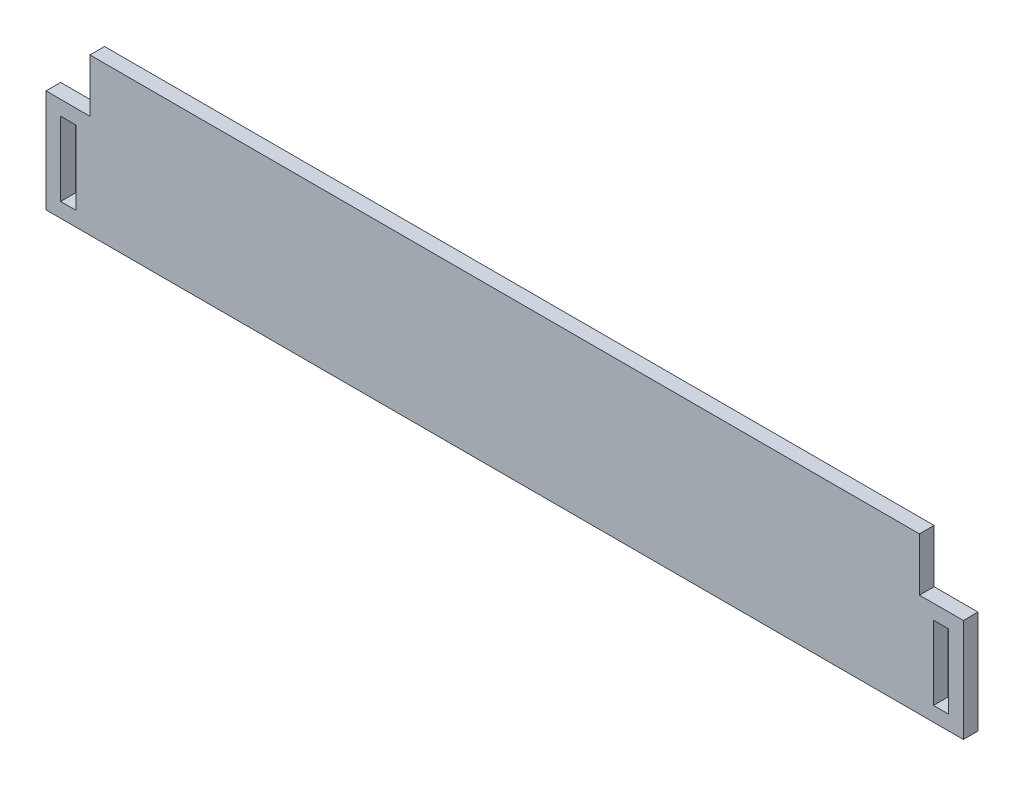
ISO-10303-21;
HEADER;
FILE_DESCRIPTION(('STEP AP214'),'2;1');
FILE_NAME('part.step','',(''),(''),'','','');
FILE_SCHEMA(('AUTOMOTIVE_DESIGN { 1 0 10303 214 1 1 1 1 }'));
ENDSEC;
DATA;
#1=APPLICATION_CONTEXT('core data for automotive mechanical design processes');
#2=APPLICATION_PROTOCOL_DEFINITION('international standard','automotive_design',2000,#1);
#3=PRODUCT_CONTEXT('',#1,'mechanical');
#4=PRODUCT('Part','Part','',(#3));
#5=PRODUCT_RELATED_PRODUCT_CATEGORY('part','',(#4));
#6=PRODUCT_DEFINITION_FORMATION('','',#4);
#7=PRODUCT_DEFINITION_CONTEXT('part definition',#1,'design');
#8=PRODUCT_DEFINITION('design','',#6,#7);
#9=PRODUCT_DEFINITION_SHAPE('','',#8);
#10=(LENGTH_UNIT() NAMED_UNIT(*) SI_UNIT(.MILLI.,.METRE.));
#11=(NAMED_UNIT(*) PLANE_ANGLE_UNIT() SI_UNIT($,.RADIAN.));
#12=(NAMED_UNIT(*) SI_UNIT($,.STERADIAN.) SOLID_ANGLE_UNIT());
#13=UNCERTAINTY_MEASURE_WITH_UNIT(LENGTH_MEASURE(1.E-05),#10,'distance_accuracy_value','');
#14=(GEOMETRIC_REPRESENTATION_CONTEXT(3) GLOBAL_UNCERTAINTY_ASSIGNED_CONTEXT((#13)) GLOBAL_UNIT_ASSIGNED_CONTEXT((#10,
#11,#12)) REPRESENTATION_CONTEXT('',''));
#15=CARTESIAN_POINT('',(0.,0.,0.));
#16=DIRECTION('',(0.,0.,1.));
#17=DIRECTION('',(1.,0.,0.));
#18=AXIS2_PLACEMENT_3D('',#15,#16,#17);
#19=CARTESIAN_POINT('',(0.,18.123,3.));
#20=DIRECTION('',(0.,-1.,0.));
#21=DIRECTION('',(0.,0.,-1.));
#22=AXIS2_PLACEMENT_3D('',#19,#20,#21);
#23=PLANE('',#22);
#24=DIRECTION('',(-1.,0.,0.));
#25=VECTOR('',#24,1.);
#26=CARTESIAN_POINT('',(0.,18.123,0.));
#27=LINE('',#26,#25);
#28=CARTESIAN_POINT('',(91.,18.123,0.));
#29=VERTEX_POINT('',#28);
#30=CARTESIAN_POINT('',(87.877,18.123,0.));
#31=VERTEX_POINT('',#30);
#32=EDGE_CURVE('E253',#29,#31,#27,.T.);
#33=ORIENTED_EDGE('',*,*,#32,.F.);
#34=DIRECTION('',(0.,0.,-1.));
#35=VECTOR('',#34,1.);
#36=CARTESIAN_POINT('',(91.,18.123,3.));
#37=LINE('',#36,#35);
#38=CARTESIAN_POINT('',(91.,18.123,3.));
#39=VERTEX_POINT('',#38);
#40=EDGE_CURVE('E11',#39,#29,#37,.T.);
#41=ORIENTED_EDGE('',*,*,#40,.F.);
#42=DIRECTION('',(-1.,0.,0.));
#43=VECTOR('',#42,1.);
#44=CARTESIAN_POINT('',(0.,18.123,3.));
#45=LINE('',#44,#43);
#46=CARTESIAN_POINT('',(87.877,18.123,3.));
#47=VERTEX_POINT('',#46);
#48=EDGE_CURVE('E173',#39,#47,#45,.T.);
#49=ORIENTED_EDGE('',*,*,#48,.T.);
#50=DIRECTION('',(0.,0.,-1.));
#51=VECTOR('',#50,1.);
#52=CARTESIAN_POINT('',(87.877,18.123,3.));
#53=LINE('',#52,#51);
#54=EDGE_CURVE('E58',#47,#31,#53,.T.);
#55=ORIENTED_EDGE('',*,*,#54,.T.);
#56=EDGE_LOOP('',(#33,#41,#49,#55));
#57=FACE_BOUND('',#56,.T.);
#58=ADVANCED_FACE('F39',(#57),#23,.T.);
#59=CARTESIAN_POINT('',(91.,0.,3.));
#60=DIRECTION('',(1.,0.,0.));
#61=DIRECTION('',(0.,0.,-1.));
#62=AXIS2_PLACEMENT_3D('',#59,#60,#61);
#63=PLANE('',#62);
#64=DIRECTION('',(0.,-1.,0.));
#65=VECTOR('',#64,1.);
#66=CARTESIAN_POINT('',(91.,0.,0.));
#67=LINE('',#66,#65);
#68=CARTESIAN_POINT('',(91.,2.99300000000004,0.));
#69=VERTEX_POINT('',#68);
#70=EDGE_CURVE('E178',#29,#69,#67,.T.);
#71=ORIENTED_EDGE('',*,*,#70,.T.);
#72=DIRECTION('',(0.,0.,-1.));
#73=VECTOR('',#72,1.);
#74=CARTESIAN_POINT('',(91.,2.99300000000004,3.));
#75=LINE('',#74,#73);
#76=CARTESIAN_POINT('',(91.,2.99300000000004,3.));
#77=VERTEX_POINT('',#76);
#78=EDGE_CURVE('E49',#77,#69,#75,.T.);
#79=ORIENTED_EDGE('',*,*,#78,.F.);
#80=DIRECTION('',(0.,-1.,0.));
#81=VECTOR('',#80,1.);
#82=CARTESIAN_POINT('',(91.,0.,3.));
#83=LINE('',#82,#81);
#84=EDGE_CURVE('E168',#39,#77,#83,.T.);
#85=ORIENTED_EDGE('',*,*,#84,.F.);
#86=ORIENTED_EDGE('',*,*,#40,.T.);
#87=EDGE_LOOP('',(#71,#79,#85,#86));
#88=FACE_BOUND('',#87,.T.);
#89=ADVANCED_FACE('F176',(#88),#63,.F.);
#90=CARTESIAN_POINT('',(0.,2.99300000000003,3.));
#91=DIRECTION('',(0.,-1.,0.));
#92=DIRECTION('',(1.,0.,0.));
#93=AXIS2_PLACEMENT_3D('',#90,#91,#92);
#94=PLANE('',#93);
#95=DIRECTION('',(-1.,0.,0.));
#96=VECTOR('',#95,1.);
#97=CARTESIAN_POINT('',(0.,2.99300000000003,0.));
#98=LINE('',#97,#96);
#99=CARTESIAN_POINT('',(87.877,2.99300000000004,0.));
#100=VERTEX_POINT('',#99);
#101=EDGE_CURVE('E256',#69,#100,#98,.T.);
#102=ORIENTED_EDGE('',*,*,#101,.T.);
#103=DIRECTION('',(0.,0.,-1.));
#104=VECTOR('',#103,1.);
#105=CARTESIAN_POINT('',(87.877,2.99300000000004,3.));
#106=LINE('',#105,#104);
#107=CARTESIAN_POINT('',(87.877,2.99300000000004,3.));
#108=VERTEX_POINT('',#107);
#109=EDGE_CURVE('E108',#108,#100,#106,.T.);
#110=ORIENTED_EDGE('',*,*,#109,.F.);
#111=DIRECTION('',(-1.,0.,0.));
#112=VECTOR('',#111,1.);
#113=CARTESIAN_POINT('',(0.,2.99300000000003,3.));
#114=LINE('',#113,#112);
#115=EDGE_CURVE('E160',#77,#108,#114,.T.);
#116=ORIENTED_EDGE('',*,*,#115,.F.);
#117=ORIENTED_EDGE('',*,*,#78,.T.);
#118=EDGE_LOOP('',(#102,#110,#116,#117));
#119=FACE_BOUND('',#118,.T.);
#120=ADVANCED_FACE('F162',(#119),#94,.F.);
#121=CARTESIAN_POINT('',(0.,18.123,3.));
#122=DIRECTION('',(0.,1.,0.));
#123=DIRECTION('',(0.,0.,1.));
#124=AXIS2_PLACEMENT_3D('',#121,#122,#123);
#125=PLANE('',#124);
#126=DIRECTION('',(1.,0.,0.));
#127=VECTOR('',#126,1.);
#128=CARTESIAN_POINT('',(0.,18.123,0.));
#129=LINE('',#128,#127);
#130=CARTESIAN_POINT('',(-91.,18.123,0.));
#131=VERTEX_POINT('',#130);
#132=CARTESIAN_POINT('',(-87.877,18.123,0.));
#133=VERTEX_POINT('',#132);
#134=EDGE_CURVE('E241',#131,#133,#129,.T.);
#135=ORIENTED_EDGE('',*,*,#134,.T.);
#136=DIRECTION('',(0.,0.,-1.));
#137=VECTOR('',#136,1.);
#138=CARTESIAN_POINT('',(-87.877,18.123,3.));
#139=LINE('',#138,#137);
#140=CARTESIAN_POINT('',(-87.877,18.123,3.));
#141=VERTEX_POINT('',#140);
#142=EDGE_CURVE('E189',#141,#133,#139,.T.);
#143=ORIENTED_EDGE('',*,*,#142,.F.);
#144=DIRECTION('',(1.,0.,0.));
#145=VECTOR('',#144,1.);
#146=CARTESIAN_POINT('',(0.,18.123,3.));
#147=LINE('',#146,#145);
#148=CARTESIAN_POINT('',(-91.,18.123,3.));
#149=VERTEX_POINT('',#148);
#150=EDGE_CURVE('E280',#149,#141,#147,.T.);
#151=ORIENTED_EDGE('',*,*,#150,.F.);
#152=DIRECTION('',(0.,0.,-1.));
#153=VECTOR('',#152,1.);
#154=CARTESIAN_POINT('',(-91.,18.123,3.));
#155=LINE('',#154,#153);
#156=EDGE_CURVE('E183',#149,#131,#155,.T.);
#157=ORIENTED_EDGE('',*,*,#156,.T.);
#158=EDGE_LOOP('',(#135,#143,#151,#157));
#159=FACE_BOUND('',#158,.T.);
#160=ADVANCED_FACE('F324',(#159),#125,.F.);
#161=CARTESIAN_POINT('',(-87.877,0.,3.));
#162=DIRECTION('',(1.,0.,0.));
#163=DIRECTION('',(0.,0.,-1.));
#164=AXIS2_PLACEMENT_3D('',#161,#162,#163);
#165=PLANE('',#164);
#166=DIRECTION('',(0.,-1.,0.));
#167=VECTOR('',#166,1.);
#168=CARTESIAN_POINT('',(-87.877,0.,0.));
#169=LINE('',#168,#167);
#170=CARTESIAN_POINT('',(-87.877,2.99300000000002,0.));
#171=VERTEX_POINT('',#170);
#172=EDGE_CURVE('E244',#133,#171,#169,.T.);
#173=ORIENTED_EDGE('',*,*,#172,.T.);
#174=DIRECTION('',(0.,0.,-1.));
#175=VECTOR('',#174,1.);
#176=CARTESIAN_POINT('',(-87.877,2.99300000000002,3.));
#177=LINE('',#176,#175);
#178=CARTESIAN_POINT('',(-87.877,2.99300000000002,3.));
#179=VERTEX_POINT('',#178);
#180=EDGE_CURVE('E187',#179,#171,#177,.T.);
#181=ORIENTED_EDGE('',*,*,#180,.F.);
#182=DIRECTION('',(0.,-1.,0.));
#183=VECTOR('',#182,1.);
#184=CARTESIAN_POINT('',(-87.877,0.,3.));
#185=LINE('',#184,#183);
#186=EDGE_CURVE('E283',#141,#179,#185,.T.);
#187=ORIENTED_EDGE('',*,*,#186,.F.);
#188=ORIENTED_EDGE('',*,*,#142,.T.);
#189=EDGE_LOOP('',(#173,#181,#187,#188));
#190=FACE_BOUND('',#189,.T.);
#191=ADVANCED_FACE('F320',(#190),#165,.F.);
#192=CARTESIAN_POINT('',(0.,2.99300000000002,3.));
#193=DIRECTION('',(0.,1.,0.));
#194=DIRECTION('',(0.,0.,1.));
#195=AXIS2_PLACEMENT_3D('',#192,#193,#194);
#196=PLANE('',#195);
#197=DIRECTION('',(1.,0.,0.));
#198=VECTOR('',#197,1.);
#199=CARTESIAN_POINT('',(0.,2.99300000000002,0.));
#200=LINE('',#199,#198);
#201=CARTESIAN_POINT('',(-91.,2.99300000000002,0.));
#202=VERTEX_POINT('',#201);
#203=EDGE_CURVE('E247',#202,#171,#200,.T.);
#204=ORIENTED_EDGE('',*,*,#203,.F.);
#205=DIRECTION('',(0.,0.,-1.));
#206=VECTOR('',#205,1.);
#207=CARTESIAN_POINT('',(-91.,2.99300000000002,3.));
#208=LINE('',#207,#206);
#209=CARTESIAN_POINT('',(-91.,2.99300000000002,3.));
#210=VERTEX_POINT('',#209);
#211=EDGE_CURVE('E185',#210,#202,#208,.T.);
#212=ORIENTED_EDGE('',*,*,#211,.F.);
#213=DIRECTION('',(1.,0.,0.));
#214=VECTOR('',#213,1.);
#215=CARTESIAN_POINT('',(0.,2.99300000000002,3.));
#216=LINE('',#215,#214);
#217=EDGE_CURVE('E285',#210,#179,#216,.T.);
#218=ORIENTED_EDGE('',*,*,#217,.T.);
#219=ORIENTED_EDGE('',*,*,#180,.T.);
#220=EDGE_LOOP('',(#204,#212,#218,#219));
#221=FACE_BOUND('',#220,.T.);
#222=ADVANCED_FACE('F317',(#221),#196,.T.);
#223=CARTESIAN_POINT('',(-94.,0.,3.));
#224=DIRECTION('',(1.,0.,0.));
#225=DIRECTION('',(0.,0.,-1.));
#226=AXIS2_PLACEMENT_3D('',#223,#224,#225);
#227=PLANE('',#226);
#228=DIRECTION('',(0.,-1.,0.));
#229=VECTOR('',#228,1.);
#230=CARTESIAN_POINT('',(-94.,0.,0.));
#231=LINE('',#230,#229);
#232=CARTESIAN_POINT('',(-94.,21.123,0.));
#233=VERTEX_POINT('',#232);
#234=CARTESIAN_POINT('',(-94.,0.,0.));
#235=VERTEX_POINT('',#234);
#236=EDGE_CURVE('E218',#233,#235,#231,.T.);
#237=ORIENTED_EDGE('',*,*,#236,.T.);
#238=DIRECTION('',(0.,0.,-1.));
#239=VECTOR('',#238,1.);
#240=CARTESIAN_POINT('',(-94.,0.,3.));
#241=LINE('',#240,#239);
#242=CARTESIAN_POINT('',(-94.,0.,3.));
#243=VERTEX_POINT('',#242);
#244=EDGE_CURVE('E43',#243,#235,#241,.T.);
#245=ORIENTED_EDGE('',*,*,#244,.F.);
#246=DIRECTION('',(0.,-1.,0.));
#247=VECTOR('',#246,1.);
#248=CARTESIAN_POINT('',(-94.,0.,3.));
#249=LINE('',#248,#247);
#250=CARTESIAN_POINT('',(-94.,21.123,3.));
#251=VERTEX_POINT('',#250);
#252=EDGE_CURVE('E260',#251,#243,#249,.T.);
#253=ORIENTED_EDGE('',*,*,#252,.F.);
#254=DIRECTION('',(0.,0.,-1.));
#255=VECTOR('',#254,1.);
#256=CARTESIAN_POINT('',(-94.,21.123,3.));
#257=LINE('',#256,#255);
#258=EDGE_CURVE('E192',#251,#233,#257,.T.);
#259=ORIENTED_EDGE('',*,*,#258,.T.);
#260=EDGE_LOOP('',(#237,#245,#253,#259));
#261=FACE_BOUND('',#260,.T.);
#262=ADVANCED_FACE('F41',(#261),#227,.F.);
#263=CARTESIAN_POINT('',(0.,0.,3.));
#264=DIRECTION('',(0.,1.,0.));
#265=DIRECTION('',(-1.,0.,0.));
#266=AXIS2_PLACEMENT_3D('',#263,#264,#265);
#267=PLANE('',#266);
#268=DIRECTION('',(1.,0.,0.));
#269=VECTOR('',#268,1.);
#270=CARTESIAN_POINT('',(0.,0.,0.));
#271=LINE('',#270,#269);
#272=CARTESIAN_POINT('',(94.,0.,0.));
#273=VERTEX_POINT('',#272);
#274=EDGE_CURVE('E213',#235,#273,#271,.T.);
#275=ORIENTED_EDGE('',*,*,#274,.T.);
#276=DIRECTION('',(0.,0.,-1.));
#277=VECTOR('',#276,1.);
#278=CARTESIAN_POINT('',(94.,0.,3.));
#279=LINE('',#278,#277);
#280=CARTESIAN_POINT('',(94.,0.,3.));
#281=VERTEX_POINT('',#280);
#282=EDGE_CURVE('E205',#281,#273,#279,.T.);
#283=ORIENTED_EDGE('',*,*,#282,.F.);
#284=DIRECTION('',(1.,0.,0.));
#285=VECTOR('',#284,1.);
#286=CARTESIAN_POINT('',(0.,0.,3.));
#287=LINE('',#286,#285);
#288=EDGE_CURVE('E121',#243,#281,#287,.T.);
#289=ORIENTED_EDGE('',*,*,#288,.F.);
#290=ORIENTED_EDGE('',*,*,#244,.T.);
#291=EDGE_LOOP('',(#275,#283,#289,#290));
#292=FACE_BOUND('',#291,.T.);
#293=ADVANCED_FACE('F212',(#292),#267,.F.);
#294=CARTESIAN_POINT('',(94.,0.,3.));
#295=DIRECTION('',(1.,0.,0.));
#296=DIRECTION('',(0.,0.,-1.));
#297=AXIS2_PLACEMENT_3D('',#294,#295,#296);
#298=PLANE('',#297);
#299=DIRECTION('',(0.,-1.,0.));
#300=VECTOR('',#299,1.);
#301=CARTESIAN_POINT('',(94.,0.,0.));
#302=LINE('',#301,#300);
#303=CARTESIAN_POINT('',(94.,21.123,0.));
#304=VERTEX_POINT('',#303);
#305=EDGE_CURVE('E223',#304,#273,#302,.T.);
#306=ORIENTED_EDGE('',*,*,#305,.F.);
#307=DIRECTION('',(0.,0.,-1.));
#308=VECTOR('',#307,1.);
#309=CARTESIAN_POINT('',(94.,21.123,3.));
#310=LINE('',#309,#308);
#311=CARTESIAN_POINT('',(94.,21.123,3.));
#312=VERTEX_POINT('',#311);
#313=EDGE_CURVE('E204',#312,#304,#310,.T.);
#314=ORIENTED_EDGE('',*,*,#313,.F.);
#315=DIRECTION('',(0.,-1.,0.));
#316=VECTOR('',#315,1.);
#317=CARTESIAN_POINT('',(94.,0.,3.));
#318=LINE('',#317,#316);
#319=EDGE_CURVE('E264',#312,#281,#318,.T.);
#320=ORIENTED_EDGE('',*,*,#319,.T.);
#321=ORIENTED_EDGE('',*,*,#282,.T.);
#322=EDGE_LOOP('',(#306,#314,#320,#321));
#323=FACE_BOUND('',#322,.T.);
#324=ADVANCED_FACE('F343',(#323),#298,.T.);
#325=CARTESIAN_POINT('',(0.,21.123,3.));
#326=DIRECTION('',(0.,1.,0.));
#327=DIRECTION('',(0.,0.,1.));
#328=AXIS2_PLACEMENT_3D('',#325,#326,#327);
#329=PLANE('',#328);
#330=DIRECTION('',(1.,0.,0.));
#331=VECTOR('',#330,1.);
#332=CARTESIAN_POINT('',(0.,21.123,0.));
#333=LINE('',#332,#331);
#334=CARTESIAN_POINT('',(85.,21.123,0.));
#335=VERTEX_POINT('',#334);
#336=EDGE_CURVE('E228',#335,#304,#333,.T.);
#337=ORIENTED_EDGE('',*,*,#336,.F.);
#338=DIRECTION('',(0.,0.,-1.));
#339=VECTOR('',#338,1.);
#340=CARTESIAN_POINT('',(85.,21.123,3.));
#341=LINE('',#340,#339);
#342=CARTESIAN_POINT('',(85.,21.123,3.));
#343=VERTEX_POINT('',#342);
#344=EDGE_CURVE('E202',#343,#335,#341,.T.);
#345=ORIENTED_EDGE('',*,*,#344,.F.);
#346=DIRECTION('',(1.,0.,0.));
#347=VECTOR('',#346,1.);
#348=CARTESIAN_POINT('',(0.,21.123,3.));
#349=LINE('',#348,#347);
#350=EDGE_CURVE('E268',#343,#312,#349,.T.);
#351=ORIENTED_EDGE('',*,*,#350,.T.);
#352=ORIENTED_EDGE('',*,*,#313,.T.);
#353=EDGE_LOOP('',(#337,#345,#351,#352));
#354=FACE_BOUND('',#353,.T.);
#355=ADVANCED_FACE('F339',(#354),#329,.T.);
#356=CARTESIAN_POINT('',(85.,0.,3.));
#357=DIRECTION('',(-1.,0.,0.));
#358=DIRECTION('',(0.,0.,1.));
#359=AXIS2_PLACEMENT_3D('',#356,#357,#358);
#360=PLANE('',#359);
#361=DIRECTION('',(0.,1.,0.));
#362=VECTOR('',#361,1.);
#363=CARTESIAN_POINT('',(85.,0.,0.));
#364=LINE('',#363,#362);
#365=CARTESIAN_POINT('',(85.,32.,0.));
#366=VERTEX_POINT('',#365);
#367=EDGE_CURVE('E231',#335,#366,#364,.T.);
#368=ORIENTED_EDGE('',*,*,#367,.T.);
#369=DIRECTION('',(0.,0.,-1.));
#370=VECTOR('',#369,1.);
#371=CARTESIAN_POINT('',(85.,32.,3.));
#372=LINE('',#371,#370);
#373=CARTESIAN_POINT('',(85.,32.,3.));
#374=VERTEX_POINT('',#373);
#375=EDGE_CURVE('E199',#374,#366,#372,.T.);
#376=ORIENTED_EDGE('',*,*,#375,.F.);
#377=DIRECTION('',(0.,1.,0.));
#378=VECTOR('',#377,1.);
#379=CARTESIAN_POINT('',(85.,0.,3.));
#380=LINE('',#379,#378);
#381=EDGE_CURVE('E271',#343,#374,#380,.T.);
#382=ORIENTED_EDGE('',*,*,#381,.F.);
#383=ORIENTED_EDGE('',*,*,#344,.T.);
#384=EDGE_LOOP('',(#368,#376,#382,#383));
#385=FACE_BOUND('',#384,.T.);
#386=ADVANCED_FACE('F335',(#385),#360,.F.);
#387=CARTESIAN_POINT('',(0.,32.,3.));
#388=DIRECTION('',(0.,-1.,0.));
#389=DIRECTION('',(1.,0.,0.));
#390=AXIS2_PLACEMENT_3D('',#387,#388,#389);
#391=PLANE('',#390);
#392=DIRECTION('',(-1.,0.,0.));
#393=VECTOR('',#392,1.);
#394=CARTESIAN_POINT('',(0.,32.,0.));
#395=LINE('',#394,#393);
#396=CARTESIAN_POINT('',(-85.,32.,0.));
#397=VERTEX_POINT('',#396);
#398=EDGE_CURVE('E233',#366,#397,#395,.T.);
#399=ORIENTED_EDGE('',*,*,#398,.T.);
#400=DIRECTION('',(0.,0.,-1.));
#401=VECTOR('',#400,1.);
#402=CARTESIAN_POINT('',(-85.,32.,3.));
#403=LINE('',#402,#401);
#404=CARTESIAN_POINT('',(-85.,32.,3.));
#405=VERTEX_POINT('',#404);
#406=EDGE_CURVE('E197',#405,#397,#403,.T.);
#407=ORIENTED_EDGE('',*,*,#406,.F.);
#408=DIRECTION('',(-1.,0.,0.));
#409=VECTOR('',#408,1.);
#410=CARTESIAN_POINT('',(0.,32.,3.));
#411=LINE('',#410,#409);
#412=EDGE_CURVE('E273',#374,#405,#411,.T.);
#413=ORIENTED_EDGE('',*,*,#412,.F.);
#414=ORIENTED_EDGE('',*,*,#375,.T.);
#415=EDGE_LOOP('',(#399,#407,#413,#414));
#416=FACE_BOUND('',#415,.T.);
#417=ADVANCED_FACE('F331',(#416),#391,.F.);
#418=CARTESIAN_POINT('',(-85.,0.,3.));
#419=DIRECTION('',(-1.,0.,0.));
#420=DIRECTION('',(0.,0.,1.));
#421=AXIS2_PLACEMENT_3D('',#418,#419,#420);
#422=PLANE('',#421);
#423=DIRECTION('',(0.,1.,0.));
#424=VECTOR('',#423,1.);
#425=CARTESIAN_POINT('',(-85.,0.,0.));
#426=LINE('',#425,#424);
#427=CARTESIAN_POINT('',(-85.,21.123,0.));
#428=VERTEX_POINT('',#427);
#429=EDGE_CURVE('E236',#428,#397,#426,.T.);
#430=ORIENTED_EDGE('',*,*,#429,.F.);
#431=DIRECTION('',(0.,0.,-1.));
#432=VECTOR('',#431,1.);
#433=CARTESIAN_POINT('',(-85.,21.123,3.));
#434=LINE('',#433,#432);
#435=CARTESIAN_POINT('',(-85.,21.123,3.));
#436=VERTEX_POINT('',#435);
#437=EDGE_CURVE('E195',#436,#428,#434,.T.);
#438=ORIENTED_EDGE('',*,*,#437,.F.);
#439=DIRECTION('',(0.,1.,0.));
#440=VECTOR('',#439,1.);
#441=CARTESIAN_POINT('',(-85.,0.,3.));
#442=LINE('',#441,#440);
#443=EDGE_CURVE('E275',#436,#405,#442,.T.);
#444=ORIENTED_EDGE('',*,*,#443,.T.);
#445=ORIENTED_EDGE('',*,*,#406,.T.);
#446=EDGE_LOOP('',(#430,#438,#444,#445));
#447=FACE_BOUND('',#446,.T.);
#448=ADVANCED_FACE('F315',(#447),#422,.T.);
#449=CARTESIAN_POINT('',(-91.,0.,3.));
#450=DIRECTION('',(1.,0.,0.));
#451=DIRECTION('',(0.,0.,-1.));
#452=AXIS2_PLACEMENT_3D('',#449,#450,#451);
#453=PLANE('',#452);
#454=DIRECTION('',(0.,-1.,0.));
#455=VECTOR('',#454,1.);
#456=CARTESIAN_POINT('',(-91.,0.,0.));
#457=LINE('',#456,#455);
#458=EDGE_CURVE('E250',#131,#202,#457,.T.);
#459=ORIENTED_EDGE('',*,*,#458,.F.);
#460=ORIENTED_EDGE('',*,*,#156,.F.);
#461=DIRECTION('',(0.,-1.,0.));
#462=VECTOR('',#461,1.);
#463=CARTESIAN_POINT('',(-91.,0.,3.));
#464=LINE('',#463,#462);
#465=EDGE_CURVE('E288',#149,#210,#464,.T.);
#466=ORIENTED_EDGE('',*,*,#465,.T.);
#467=ORIENTED_EDGE('',*,*,#211,.T.);
#468=EDGE_LOOP('',(#459,#460,#466,#467));
#469=FACE_BOUND('',#468,.T.);
#470=ADVANCED_FACE('F301',(#469),#453,.T.);
#471=CARTESIAN_POINT('',(0.,21.123,3.));
#472=DIRECTION('',(0.,-1.,0.));
#473=DIRECTION('',(1.,0.,0.));
#474=AXIS2_PLACEMENT_3D('',#471,#472,#473);
#475=PLANE('',#474);
#476=DIRECTION('',(-1.,0.,0.));
#477=VECTOR('',#476,1.);
#478=CARTESIAN_POINT('',(0.,21.123,0.));
#479=LINE('',#478,#477);
#480=EDGE_CURVE('E239',#428,#233,#479,.T.);
#481=ORIENTED_EDGE('',*,*,#480,.T.);
#482=ORIENTED_EDGE('',*,*,#258,.F.);
#483=DIRECTION('',(-1.,0.,0.));
#484=VECTOR('',#483,1.);
#485=CARTESIAN_POINT('',(0.,21.123,3.));
#486=LINE('',#485,#484);
#487=EDGE_CURVE('E278',#436,#251,#486,.T.);
#488=ORIENTED_EDGE('',*,*,#487,.F.);
#489=ORIENTED_EDGE('',*,*,#437,.T.);
#490=EDGE_LOOP('',(#481,#482,#488,#489));
#491=FACE_BOUND('',#490,.T.);
#492=ADVANCED_FACE('F293',(#491),#475,.F.);
#493=CARTESIAN_POINT('',(87.877,0.,3.));
#494=DIRECTION('',(1.,0.,0.));
#495=DIRECTION('',(0.,0.,-1.));
#496=AXIS2_PLACEMENT_3D('',#493,#494,#495);
#497=PLANE('',#496);
#498=DIRECTION('',(0.,-1.,0.));
#499=VECTOR('',#498,1.);
#500=CARTESIAN_POINT('',(87.877,0.,0.));
#501=LINE('',#500,#499);
#502=EDGE_CURVE('E258',#31,#100,#501,.T.);
#503=ORIENTED_EDGE('',*,*,#502,.F.);
#504=ORIENTED_EDGE('',*,*,#54,.F.);
#505=DIRECTION('',(0.,-1.,0.));
#506=VECTOR('',#505,1.);
#507=CARTESIAN_POINT('',(87.877,0.,3.));
#508=LINE('',#507,#506);
#509=EDGE_CURVE('E167',#47,#108,#508,.T.);
#510=ORIENTED_EDGE('',*,*,#509,.T.);
#511=ORIENTED_EDGE('',*,*,#109,.T.);
#512=EDGE_LOOP('',(#503,#504,#510,#511));
#513=FACE_BOUND('',#512,.T.);
#514=ADVANCED_FACE('F291',(#513),#497,.T.);
#515=CARTESIAN_POINT('',(0.,0.,3.));
#516=DIRECTION('',(0.,0.,1.));
#517=DIRECTION('',(1.,0.,0.));
#518=AXIS2_PLACEMENT_3D('',#515,#516,#517);
#519=PLANE('',#518);
#520=ORIENTED_EDGE('',*,*,#252,.T.);
#521=ORIENTED_EDGE('',*,*,#288,.T.);
#522=ORIENTED_EDGE('',*,*,#319,.F.);
#523=ORIENTED_EDGE('',*,*,#350,.F.);
#524=ORIENTED_EDGE('',*,*,#381,.T.);
#525=ORIENTED_EDGE('',*,*,#412,.T.);
#526=ORIENTED_EDGE('',*,*,#443,.F.);
#527=ORIENTED_EDGE('',*,*,#487,.T.);
#528=EDGE_LOOP('',(#520,#521,#522,#523,#524,#525,#526,#527));
#529=FACE_BOUND('',#528,.T.);
#530=ORIENTED_EDGE('',*,*,#150,.T.);
#531=ORIENTED_EDGE('',*,*,#186,.T.);
#532=ORIENTED_EDGE('',*,*,#217,.F.);
#533=ORIENTED_EDGE('',*,*,#465,.F.);
#534=EDGE_LOOP('',(#530,#531,#532,#533));
#535=FACE_BOUND('',#534,.T.);
#536=ORIENTED_EDGE('',*,*,#48,.F.);
#537=ORIENTED_EDGE('',*,*,#84,.T.);
#538=ORIENTED_EDGE('',*,*,#115,.T.);
#539=ORIENTED_EDGE('',*,*,#509,.F.);
#540=EDGE_LOOP('',(#536,#537,#538,#539));
#541=FACE_BOUND('',#540,.T.);
#542=ADVANCED_FACE('F172',(#529,#535,#541),#519,.T.);
#543=CARTESIAN_POINT('',(0.,0.,0.));
#544=DIRECTION('',(0.,0.,1.));
#545=DIRECTION('',(1.,0.,0.));
#546=AXIS2_PLACEMENT_3D('',#543,#544,#545);
#547=PLANE('',#546);
#548=ORIENTED_EDGE('',*,*,#236,.F.);
#549=ORIENTED_EDGE('',*,*,#480,.F.);
#550=ORIENTED_EDGE('',*,*,#429,.T.);
#551=ORIENTED_EDGE('',*,*,#398,.F.);
#552=ORIENTED_EDGE('',*,*,#367,.F.);
#553=ORIENTED_EDGE('',*,*,#336,.T.);
#554=ORIENTED_EDGE('',*,*,#305,.T.);
#555=ORIENTED_EDGE('',*,*,#274,.F.);
#556=EDGE_LOOP('',(#548,#549,#550,#551,#552,#553,#554,#555));
#557=FACE_BOUND('',#556,.T.);
#558=ORIENTED_EDGE('',*,*,#134,.F.);
#559=ORIENTED_EDGE('',*,*,#458,.T.);
#560=ORIENTED_EDGE('',*,*,#203,.T.);
#561=ORIENTED_EDGE('',*,*,#172,.F.);
#562=EDGE_LOOP('',(#558,#559,#560,#561));
#563=FACE_BOUND('',#562,.T.);
#564=ORIENTED_EDGE('',*,*,#32,.T.);
#565=ORIENTED_EDGE('',*,*,#502,.T.);
#566=ORIENTED_EDGE('',*,*,#101,.F.);
#567=ORIENTED_EDGE('',*,*,#70,.F.);
#568=EDGE_LOOP('',(#564,#565,#566,#567));
#569=FACE_BOUND('',#568,.T.);
#570=ADVANCED_FACE('F299',(#557,#563,#569),#547,.F.);
#571=CLOSED_SHELL('',(#58,#89,#120,#160,#191,#222,#262,#293,#324,#355,#386,#417,#448,#470,#492,
#514,#542,#570));
#572=MANIFOLD_SOLID_BREP('B2',#571);
#573=ADVANCED_BREP_SHAPE_REPRESENTATION('',(#18,#572),#14);
#574=SHAPE_DEFINITION_REPRESENTATION(#9,#573);
ENDSEC;
END-ISO-10303-21;
